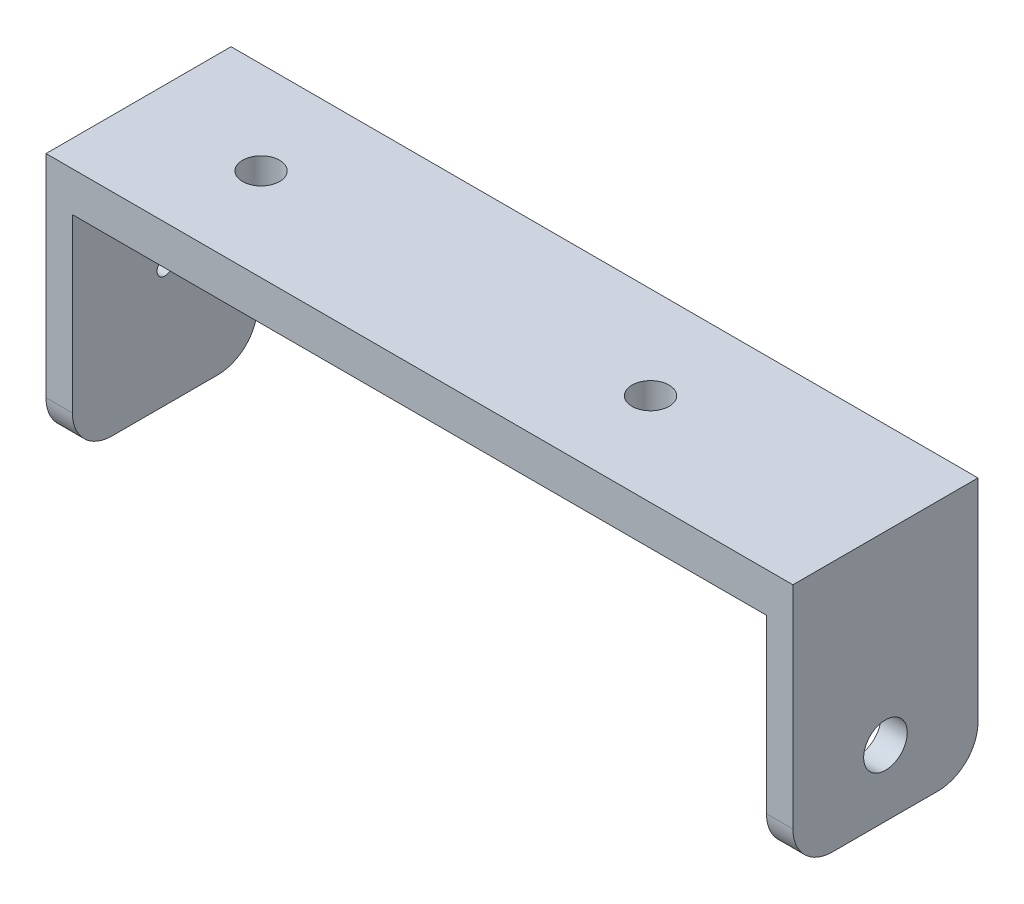
ISO-10303-21;
HEADER;
FILE_DESCRIPTION(('STEP AP214'),'2;1');
FILE_NAME('part.step','',(''),(''),'','','');
FILE_SCHEMA(('AUTOMOTIVE_DESIGN { 1 0 10303 214 1 1 1 1 }'));
ENDSEC;
DATA;
#1=APPLICATION_CONTEXT('core data for automotive mechanical design processes');
#2=APPLICATION_PROTOCOL_DEFINITION('international standard','automotive_design',2000,#1);
#3=PRODUCT_CONTEXT('',#1,'mechanical');
#4=PRODUCT('Part','Part','',(#3));
#5=PRODUCT_RELATED_PRODUCT_CATEGORY('part','',(#4));
#6=PRODUCT_DEFINITION_FORMATION('','',#4);
#7=PRODUCT_DEFINITION_CONTEXT('part definition',#1,'design');
#8=PRODUCT_DEFINITION('design','',#6,#7);
#9=PRODUCT_DEFINITION_SHAPE('','',#8);
#10=(LENGTH_UNIT() NAMED_UNIT(*) SI_UNIT(.MILLI.,.METRE.));
#11=(NAMED_UNIT(*) PLANE_ANGLE_UNIT() SI_UNIT($,.RADIAN.));
#12=(NAMED_UNIT(*) SI_UNIT($,.STERADIAN.) SOLID_ANGLE_UNIT());
#13=UNCERTAINTY_MEASURE_WITH_UNIT(LENGTH_MEASURE(1.E-05),#10,'distance_accuracy_value','');
#14=(GEOMETRIC_REPRESENTATION_CONTEXT(3) GLOBAL_UNCERTAINTY_ASSIGNED_CONTEXT((#13)) GLOBAL_UNIT_ASSIGNED_CONTEXT((#10,
#11,#12)) REPRESENTATION_CONTEXT('',''));
#15=CARTESIAN_POINT('',(0.,0.,0.));
#16=DIRECTION('',(0.,0.,1.));
#17=DIRECTION('',(1.,0.,0.));
#18=AXIS2_PLACEMENT_3D('',#15,#16,#17);
#19=CARTESIAN_POINT('',(0.,16.,14.));
#20=DIRECTION('',(0.,-1.,0.));
#21=DIRECTION('',(1.,0.,0.));
#22=AXIS2_PLACEMENT_3D('',#19,#20,#21);
#23=PLANE('',#22);
#24=CARTESIAN_POINT('',(-18.98,16.,7.));
#25=DIRECTION('',(0.,-1.,0.));
#26=DIRECTION('',(1.,0.,0.));
#27=AXIS2_PLACEMENT_3D('',#24,#25,#26);
#28=CIRCLE('',#27,1.4);
#29=CARTESIAN_POINT('',(-17.58,16.,7.));
#30=VERTEX_POINT('',#29);
#31=EDGE_CURVE('E252',#30,#30,#28,.T.);
#32=ORIENTED_EDGE('',*,*,#31,.F.);
#33=EDGE_LOOP('',(#32));
#34=FACE_BOUND('',#33,.T.);
#35=CARTESIAN_POINT('',(10.48,16.,7.));
#36=DIRECTION('',(0.,-1.,0.));
#37=DIRECTION('',(1.,0.,0.));
#38=AXIS2_PLACEMENT_3D('',#35,#36,#37);
#39=CIRCLE('',#38,1.4);
#40=CARTESIAN_POINT('',(11.88,16.,7.));
#41=VERTEX_POINT('',#40);
#42=EDGE_CURVE('E247',#41,#41,#39,.T.);
#43=ORIENTED_EDGE('',*,*,#42,.F.);
#44=EDGE_LOOP('',(#43));
#45=FACE_BOUND('',#44,.T.);
#46=DIRECTION('',(-1.,0.,0.));
#47=VECTOR('',#46,1.);
#48=CARTESIAN_POINT('',(0.,16.,0.));
#49=LINE('',#48,#47);
#50=CARTESIAN_POINT('',(26.25,16.,0.));
#51=VERTEX_POINT('',#50);
#52=CARTESIAN_POINT('',(-26.25,16.,0.));
#53=VERTEX_POINT('',#52);
#54=EDGE_CURVE('E152',#51,#53,#49,.T.);
#55=ORIENTED_EDGE('',*,*,#54,.F.);
#56=DIRECTION('',(0.,0.,-1.));
#57=VECTOR('',#56,1.);
#58=CARTESIAN_POINT('',(26.25,16.,14.));
#59=LINE('',#58,#57);
#60=CARTESIAN_POINT('',(26.25,16.,14.));
#61=VERTEX_POINT('',#60);
#62=EDGE_CURVE('E139',#61,#51,#59,.T.);
#63=ORIENTED_EDGE('',*,*,#62,.F.);
#64=DIRECTION('',(-1.,0.,0.));
#65=VECTOR('',#64,1.);
#66=CARTESIAN_POINT('',(0.,16.,14.));
#67=LINE('',#66,#65);
#68=CARTESIAN_POINT('',(-26.25,16.,14.));
#69=VERTEX_POINT('',#68);
#70=EDGE_CURVE('E146',#61,#69,#67,.T.);
#71=ORIENTED_EDGE('',*,*,#70,.T.);
#72=DIRECTION('',(0.,0.,-1.));
#73=VECTOR('',#72,1.);
#74=CARTESIAN_POINT('',(-26.25,16.,14.));
#75=LINE('',#74,#73);
#76=EDGE_CURVE('E175',#69,#53,#75,.T.);
#77=ORIENTED_EDGE('',*,*,#76,.T.);
#78=EDGE_LOOP('',(#55,#63,#71,#77));
#79=FACE_BOUND('',#78,.T.);
#80=ADVANCED_FACE('F41',(#34,#45,#79),#23,.T.);
#81=CARTESIAN_POINT('',(26.25,0.,14.));
#82=DIRECTION('',(-1.,0.,0.));
#83=DIRECTION('',(0.,0.,1.));
#84=AXIS2_PLACEMENT_3D('',#81,#82,#83);
#85=PLANE('',#84);
#86=CARTESIAN_POINT('',(26.25,5.00000000000001,7.));
#87=DIRECTION('',(-1.,0.,0.));
#88=DIRECTION('',(0.,0.,1.));
#89=AXIS2_PLACEMENT_3D('',#86,#87,#88);
#90=CIRCLE('',#89,1.65);
#91=CARTESIAN_POINT('',(26.25,5.00000000000001,8.65));
#92=VERTEX_POINT('',#91);
#93=EDGE_CURVE('E164',#92,#92,#90,.F.);
#94=ORIENTED_EDGE('',*,*,#93,.T.);
#95=EDGE_LOOP('',(#94));
#96=FACE_BOUND('',#95,.T.);
#97=DIRECTION('',(0.,0.,-1.));
#98=VECTOR('',#97,1.);
#99=CARTESIAN_POINT('',(26.25,0.,14.));
#100=LINE('',#99,#98);
#101=CARTESIAN_POINT('',(26.25,0.,11.));
#102=VERTEX_POINT('',#101);
#103=CARTESIAN_POINT('',(26.25,0.,3.));
#104=VERTEX_POINT('',#103);
#105=EDGE_CURVE('E154',#102,#104,#100,.T.);
#106=ORIENTED_EDGE('',*,*,#105,.F.);
#107=CARTESIAN_POINT('',(26.25,3.,11.));
#108=DIRECTION('',(-1.,0.,0.));
#109=DIRECTION('',(0.,0.,1.));
#110=AXIS2_PLACEMENT_3D('',#107,#108,#109);
#111=CIRCLE('',#110,3.);
#112=CARTESIAN_POINT('',(26.25,3.,14.));
#113=VERTEX_POINT('',#112);
#114=EDGE_CURVE('E141',#102,#113,#111,.T.);
#115=ORIENTED_EDGE('',*,*,#114,.T.);
#116=DIRECTION('',(0.,1.,0.));
#117=VECTOR('',#116,1.);
#118=CARTESIAN_POINT('',(26.25,0.,14.));
#119=LINE('',#118,#117);
#120=EDGE_CURVE('E134',#113,#61,#119,.T.);
#121=ORIENTED_EDGE('',*,*,#120,.T.);
#122=ORIENTED_EDGE('',*,*,#62,.T.);
#123=DIRECTION('',(0.,1.,0.));
#124=VECTOR('',#123,1.);
#125=CARTESIAN_POINT('',(26.25,0.,0.));
#126=LINE('',#125,#124);
#127=CARTESIAN_POINT('',(26.25,3.,0.));
#128=VERTEX_POINT('',#127);
#129=EDGE_CURVE('E177',#128,#51,#126,.T.);
#130=ORIENTED_EDGE('',*,*,#129,.F.);
#131=CARTESIAN_POINT('',(26.25,3.,3.));
#132=DIRECTION('',(-1.,0.,0.));
#133=DIRECTION('',(0.,0.,1.));
#134=AXIS2_PLACEMENT_3D('',#131,#132,#133);
#135=CIRCLE('',#134,3.);
#136=EDGE_CURVE('E206',#128,#104,#135,.T.);
#137=ORIENTED_EDGE('',*,*,#136,.T.);
#138=EDGE_LOOP('',(#106,#115,#121,#122,#130,#137));
#139=FACE_BOUND('',#138,.T.);
#140=ADVANCED_FACE('F137',(#96,#139),#85,.T.);
#141=CARTESIAN_POINT('',(0.,0.,14.));
#142=DIRECTION('',(0.,-1.,0.));
#143=DIRECTION('',(1.,0.,0.));
#144=AXIS2_PLACEMENT_3D('',#141,#142,#143);
#145=PLANE('',#144);
#146=DIRECTION('',(0.,0.,-1.));
#147=VECTOR('',#146,1.);
#148=CARTESIAN_POINT('',(28.25,0.,14.));
#149=LINE('',#148,#147);
#150=CARTESIAN_POINT('',(28.25,0.,11.));
#151=VERTEX_POINT('',#150);
#152=CARTESIAN_POINT('',(28.25,0.,3.));
#153=VERTEX_POINT('',#152);
#154=EDGE_CURVE('E197',#151,#153,#149,.T.);
#155=ORIENTED_EDGE('',*,*,#154,.F.);
#156=DIRECTION('',(-1.,0.,0.));
#157=VECTOR('',#156,1.);
#158=CARTESIAN_POINT('',(0.,0.,11.));
#159=LINE('',#158,#157);
#160=EDGE_CURVE('E203',#151,#102,#159,.T.);
#161=ORIENTED_EDGE('',*,*,#160,.T.);
#162=ORIENTED_EDGE('',*,*,#105,.T.);
#163=DIRECTION('',(-1.,0.,0.));
#164=VECTOR('',#163,1.);
#165=CARTESIAN_POINT('',(28.25,0.,3.));
#166=LINE('',#165,#164);
#167=EDGE_CURVE('E153',#104,#153,#166,.F.);
#168=ORIENTED_EDGE('',*,*,#167,.T.);
#169=EDGE_LOOP('',(#155,#161,#162,#168));
#170=FACE_BOUND('',#169,.T.);
#171=ADVANCED_FACE('F283',(#170),#145,.T.);
#172=CARTESIAN_POINT('',(28.25,0.,14.));
#173=DIRECTION('',(1.,0.,0.));
#174=DIRECTION('',(0.,1.,0.));
#175=AXIS2_PLACEMENT_3D('',#172,#173,#174);
#176=PLANE('',#175);
#177=CARTESIAN_POINT('',(28.25,5.00000000000001,7.));
#178=DIRECTION('',(1.,0.,0.));
#179=DIRECTION('',(0.,0.,-1.));
#180=AXIS2_PLACEMENT_3D('',#177,#178,#179);
#181=CIRCLE('',#180,1.65);
#182=CARTESIAN_POINT('',(28.25,5.00000000000001,5.35));
#183=VERTEX_POINT('',#182);
#184=EDGE_CURVE('E254',#183,#183,#181,.T.);
#185=ORIENTED_EDGE('',*,*,#184,.F.);
#186=EDGE_LOOP('',(#185));
#187=FACE_BOUND('',#186,.T.);
#188=DIRECTION('',(0.,-1.,0.));
#189=VECTOR('',#188,1.);
#190=CARTESIAN_POINT('',(28.25,0.,14.));
#191=LINE('',#190,#189);
#192=CARTESIAN_POINT('',(28.25,19.,14.));
#193=VERTEX_POINT('',#192);
#194=CARTESIAN_POINT('',(28.25,3.,14.));
#195=VERTEX_POINT('',#194);
#196=EDGE_CURVE('E145',#193,#195,#191,.T.);
#197=ORIENTED_EDGE('',*,*,#196,.T.);
#198=CARTESIAN_POINT('',(28.25,3.,11.));
#199=DIRECTION('',(1.,0.,0.));
#200=DIRECTION('',(0.,1.,0.));
#201=AXIS2_PLACEMENT_3D('',#198,#199,#200);
#202=CIRCLE('',#201,3.);
#203=EDGE_CURVE('E215',#195,#151,#202,.T.);
#204=ORIENTED_EDGE('',*,*,#203,.T.);
#205=ORIENTED_EDGE('',*,*,#154,.T.);
#206=CARTESIAN_POINT('',(28.25,3.,3.));
#207=DIRECTION('',(1.,0.,0.));
#208=DIRECTION('',(0.,1.,0.));
#209=AXIS2_PLACEMENT_3D('',#206,#207,#208);
#210=CIRCLE('',#209,3.);
#211=CARTESIAN_POINT('',(28.25,3.,0.));
#212=VERTEX_POINT('',#211);
#213=EDGE_CURVE('E213',#153,#212,#210,.T.);
#214=ORIENTED_EDGE('',*,*,#213,.T.);
#215=DIRECTION('',(0.,-1.,0.));
#216=VECTOR('',#215,1.);
#217=CARTESIAN_POINT('',(28.25,0.,0.));
#218=LINE('',#217,#216);
#219=CARTESIAN_POINT('',(28.25,19.,0.));
#220=VERTEX_POINT('',#219);
#221=EDGE_CURVE('E179',#220,#212,#218,.T.);
#222=ORIENTED_EDGE('',*,*,#221,.F.);
#223=DIRECTION('',(0.,0.,-1.));
#224=VECTOR('',#223,1.);
#225=CARTESIAN_POINT('',(28.25,19.,14.));
#226=LINE('',#225,#224);
#227=EDGE_CURVE('E195',#193,#220,#226,.T.);
#228=ORIENTED_EDGE('',*,*,#227,.F.);
#229=EDGE_LOOP('',(#197,#204,#205,#214,#222,#228));
#230=FACE_BOUND('',#229,.T.);
#231=ADVANCED_FACE('F323',(#187,#230),#176,.T.);
#232=CARTESIAN_POINT('',(0.,19.,14.));
#233=DIRECTION('',(0.,1.,0.));
#234=DIRECTION('',(0.,0.,1.));
#235=AXIS2_PLACEMENT_3D('',#232,#233,#234);
#236=PLANE('',#235);
#237=CARTESIAN_POINT('',(-18.98,19.,7.));
#238=DIRECTION('',(0.,1.,0.));
#239=DIRECTION('',(0.,0.,1.));
#240=AXIS2_PLACEMENT_3D('',#237,#238,#239);
#241=CIRCLE('',#240,1.4);
#242=CARTESIAN_POINT('',(-18.98,19.,8.4));
#243=VERTEX_POINT('',#242);
#244=EDGE_CURVE('E244',#243,#243,#241,.T.);
#245=ORIENTED_EDGE('',*,*,#244,.F.);
#246=EDGE_LOOP('',(#245));
#247=FACE_BOUND('',#246,.T.);
#248=CARTESIAN_POINT('',(10.48,19.,7.));
#249=DIRECTION('',(0.,1.,0.));
#250=DIRECTION('',(0.,0.,1.));
#251=AXIS2_PLACEMENT_3D('',#248,#249,#250);
#252=CIRCLE('',#251,1.4);
#253=CARTESIAN_POINT('',(10.48,19.,8.4));
#254=VERTEX_POINT('',#253);
#255=EDGE_CURVE('E235',#254,#254,#252,.T.);
#256=ORIENTED_EDGE('',*,*,#255,.F.);
#257=EDGE_LOOP('',(#256));
#258=FACE_BOUND('',#257,.T.);
#259=DIRECTION('',(1.,0.,0.));
#260=VECTOR('',#259,1.);
#261=CARTESIAN_POINT('',(0.,19.,0.));
#262=LINE('',#261,#260);
#263=CARTESIAN_POINT('',(-28.25,19.,0.));
#264=VERTEX_POINT('',#263);
#265=EDGE_CURVE('E182',#264,#220,#262,.T.);
#266=ORIENTED_EDGE('',*,*,#265,.F.);
#267=DIRECTION('',(0.,0.,-1.));
#268=VECTOR('',#267,1.);
#269=CARTESIAN_POINT('',(-28.25,19.,14.));
#270=LINE('',#269,#268);
#271=CARTESIAN_POINT('',(-28.25,19.,14.));
#272=VERTEX_POINT('',#271);
#273=EDGE_CURVE('E192',#272,#264,#270,.T.);
#274=ORIENTED_EDGE('',*,*,#273,.F.);
#275=DIRECTION('',(1.,0.,0.));
#276=VECTOR('',#275,1.);
#277=CARTESIAN_POINT('',(0.,19.,14.));
#278=LINE('',#277,#276);
#279=EDGE_CURVE('E169',#272,#193,#278,.T.);
#280=ORIENTED_EDGE('',*,*,#279,.T.);
#281=ORIENTED_EDGE('',*,*,#227,.T.);
#282=EDGE_LOOP('',(#266,#274,#280,#281));
#283=FACE_BOUND('',#282,.T.);
#284=ADVANCED_FACE('F312',(#247,#258,#283),#236,.T.);
#285=CARTESIAN_POINT('',(-28.25,0.,14.));
#286=DIRECTION('',(-1.,0.,0.));
#287=DIRECTION('',(0.,0.,1.));
#288=AXIS2_PLACEMENT_3D('',#285,#286,#287);
#289=PLANE('',#288);
#290=CARTESIAN_POINT('',(-28.25,9.08500000000001,7.));
#291=DIRECTION('',(-1.,0.,0.));
#292=DIRECTION('',(0.,0.,1.));
#293=AXIS2_PLACEMENT_3D('',#290,#291,#292);
#294=CIRCLE('',#293,0.6);
#295=CARTESIAN_POINT('',(-28.25,9.08500000000001,7.6));
#296=VERTEX_POINT('',#295);
#297=EDGE_CURVE('E231',#296,#296,#294,.T.);
#298=ORIENTED_EDGE('',*,*,#297,.F.);
#299=EDGE_LOOP('',(#298));
#300=FACE_BOUND('',#299,.T.);
#301=CARTESIAN_POINT('',(-28.25,13.085,7.));
#302=DIRECTION('',(-1.,0.,0.));
#303=DIRECTION('',(0.,0.,1.));
#304=AXIS2_PLACEMENT_3D('',#301,#302,#303);
#305=CIRCLE('',#304,0.6);
#306=CARTESIAN_POINT('',(-28.25,13.085,7.6));
#307=VERTEX_POINT('',#306);
#308=EDGE_CURVE('E237',#307,#307,#305,.T.);
#309=ORIENTED_EDGE('',*,*,#308,.F.);
#310=EDGE_LOOP('',(#309));
#311=FACE_BOUND('',#310,.T.);
#312=DIRECTION('',(0.,0.,-1.));
#313=VECTOR('',#312,1.);
#314=CARTESIAN_POINT('',(-28.25,0.,14.));
#315=LINE('',#314,#313);
#316=CARTESIAN_POINT('',(-28.25,0.,11.));
#317=VERTEX_POINT('',#316);
#318=CARTESIAN_POINT('',(-28.25,0.,3.));
#319=VERTEX_POINT('',#318);
#320=EDGE_CURVE('E189',#317,#319,#315,.T.);
#321=ORIENTED_EDGE('',*,*,#320,.F.);
#322=CARTESIAN_POINT('',(-28.25,2.99999999999996,11.));
#323=DIRECTION('',(-1.,0.,0.));
#324=DIRECTION('',(0.,0.,1.));
#325=AXIS2_PLACEMENT_3D('',#322,#323,#324);
#326=CIRCLE('',#325,3.);
#327=CARTESIAN_POINT('',(-28.25,2.99999999999996,14.));
#328=VERTEX_POINT('',#327);
#329=EDGE_CURVE('E223',#317,#328,#326,.T.);
#330=ORIENTED_EDGE('',*,*,#329,.T.);
#331=DIRECTION('',(0.,1.,0.));
#332=VECTOR('',#331,1.);
#333=CARTESIAN_POINT('',(-28.25,0.,14.));
#334=LINE('',#333,#332);
#335=EDGE_CURVE('E172',#328,#272,#334,.T.);
#336=ORIENTED_EDGE('',*,*,#335,.T.);
#337=ORIENTED_EDGE('',*,*,#273,.T.);
#338=DIRECTION('',(0.,1.,0.));
#339=VECTOR('',#338,1.);
#340=CARTESIAN_POINT('',(-28.25,0.,0.));
#341=LINE('',#340,#339);
#342=CARTESIAN_POINT('',(-28.25,2.99999999999996,0.));
#343=VERTEX_POINT('',#342);
#344=EDGE_CURVE('E161',#343,#264,#341,.T.);
#345=ORIENTED_EDGE('',*,*,#344,.F.);
#346=CARTESIAN_POINT('',(-28.25,2.99999999999996,3.));
#347=DIRECTION('',(-1.,0.,0.));
#348=DIRECTION('',(0.,0.,1.));
#349=AXIS2_PLACEMENT_3D('',#346,#347,#348);
#350=CIRCLE('',#349,3.);
#351=EDGE_CURVE('E66',#343,#319,#350,.T.);
#352=ORIENTED_EDGE('',*,*,#351,.T.);
#353=EDGE_LOOP('',(#321,#330,#336,#337,#345,#352));
#354=FACE_BOUND('',#353,.T.);
#355=ADVANCED_FACE('F306',(#300,#311,#354),#289,.T.);
#356=CARTESIAN_POINT('',(0.,0.,14.));
#357=DIRECTION('',(0.,-1.,0.));
#358=DIRECTION('',(1.,0.,0.));
#359=AXIS2_PLACEMENT_3D('',#356,#357,#358);
#360=PLANE('',#359);
#361=DIRECTION('',(0.,0.,-1.));
#362=VECTOR('',#361,1.);
#363=CARTESIAN_POINT('',(-26.25,0.,14.));
#364=LINE('',#363,#362);
#365=CARTESIAN_POINT('',(-26.25,0.,11.));
#366=VERTEX_POINT('',#365);
#367=CARTESIAN_POINT('',(-26.25,0.,3.));
#368=VERTEX_POINT('',#367);
#369=EDGE_CURVE('E187',#366,#368,#364,.T.);
#370=ORIENTED_EDGE('',*,*,#369,.F.);
#371=DIRECTION('',(-1.,0.,0.));
#372=VECTOR('',#371,1.);
#373=CARTESIAN_POINT('',(0.,0.,11.));
#374=LINE('',#373,#372);
#375=EDGE_CURVE('E219',#366,#317,#374,.T.);
#376=ORIENTED_EDGE('',*,*,#375,.T.);
#377=ORIENTED_EDGE('',*,*,#320,.T.);
#378=DIRECTION('',(-1.,0.,0.));
#379=VECTOR('',#378,1.);
#380=CARTESIAN_POINT('',(-26.25,0.,3.));
#381=LINE('',#380,#379);
#382=EDGE_CURVE('E217',#319,#368,#381,.F.);
#383=ORIENTED_EDGE('',*,*,#382,.T.);
#384=EDGE_LOOP('',(#370,#376,#377,#383));
#385=FACE_BOUND('',#384,.T.);
#386=ADVANCED_FACE('F336',(#385),#360,.T.);
#387=CARTESIAN_POINT('',(-26.25,0.,14.));
#388=DIRECTION('',(1.,0.,0.));
#389=DIRECTION('',(0.,1.,0.));
#390=AXIS2_PLACEMENT_3D('',#387,#388,#389);
#391=PLANE('',#390);
#392=CARTESIAN_POINT('',(-26.25,9.08500000000001,7.));
#393=DIRECTION('',(1.,0.,0.));
#394=DIRECTION('',(0.,1.,0.));
#395=AXIS2_PLACEMENT_3D('',#392,#393,#394);
#396=CIRCLE('',#395,0.6);
#397=CARTESIAN_POINT('',(-26.25,9.68500000000001,7.));
#398=VERTEX_POINT('',#397);
#399=EDGE_CURVE('E45',#398,#398,#396,.T.);
#400=ORIENTED_EDGE('',*,*,#399,.F.);
#401=EDGE_LOOP('',(#400));
#402=FACE_BOUND('',#401,.T.);
#403=CARTESIAN_POINT('',(-26.25,13.085,7.));
#404=DIRECTION('',(1.,0.,0.));
#405=DIRECTION('',(0.,1.,0.));
#406=AXIS2_PLACEMENT_3D('',#403,#404,#405);
#407=CIRCLE('',#406,0.6);
#408=CARTESIAN_POINT('',(-26.25,13.685,7.));
#409=VERTEX_POINT('',#408);
#410=EDGE_CURVE('E229',#409,#409,#407,.T.);
#411=ORIENTED_EDGE('',*,*,#410,.F.);
#412=EDGE_LOOP('',(#411));
#413=FACE_BOUND('',#412,.T.);
#414=DIRECTION('',(0.,-1.,0.));
#415=VECTOR('',#414,1.);
#416=CARTESIAN_POINT('',(-26.25,0.,14.));
#417=LINE('',#416,#415);
#418=CARTESIAN_POINT('',(-26.25,2.99999999999996,14.));
#419=VERTEX_POINT('',#418);
#420=EDGE_CURVE('E158',#69,#419,#417,.T.);
#421=ORIENTED_EDGE('',*,*,#420,.T.);
#422=CARTESIAN_POINT('',(-26.25,2.99999999999996,11.));
#423=DIRECTION('',(1.,0.,0.));
#424=DIRECTION('',(0.,1.,0.));
#425=AXIS2_PLACEMENT_3D('',#422,#423,#424);
#426=CIRCLE('',#425,3.);
#427=EDGE_CURVE('E226',#419,#366,#426,.T.);
#428=ORIENTED_EDGE('',*,*,#427,.T.);
#429=ORIENTED_EDGE('',*,*,#369,.T.);
#430=CARTESIAN_POINT('',(-26.25,2.99999999999996,3.));
#431=DIRECTION('',(1.,0.,0.));
#432=DIRECTION('',(0.,1.,0.));
#433=AXIS2_PLACEMENT_3D('',#430,#431,#432);
#434=CIRCLE('',#433,3.);
#435=CARTESIAN_POINT('',(-26.25,2.99999999999996,0.));
#436=VERTEX_POINT('',#435);
#437=EDGE_CURVE('E58',#368,#436,#434,.T.);
#438=ORIENTED_EDGE('',*,*,#437,.T.);
#439=DIRECTION('',(0.,-1.,0.));
#440=VECTOR('',#439,1.);
#441=CARTESIAN_POINT('',(-26.25,0.,0.));
#442=LINE('',#441,#440);
#443=EDGE_CURVE('E159',#53,#436,#442,.T.);
#444=ORIENTED_EDGE('',*,*,#443,.F.);
#445=ORIENTED_EDGE('',*,*,#76,.F.);
#446=EDGE_LOOP('',(#421,#428,#429,#438,#444,#445));
#447=FACE_BOUND('',#446,.T.);
#448=ADVANCED_FACE('F340',(#402,#413,#447),#391,.T.);
#449=CARTESIAN_POINT('',(0.,0.,14.));
#450=DIRECTION('',(0.,0.,1.));
#451=DIRECTION('',(1.,0.,0.));
#452=AXIS2_PLACEMENT_3D('',#449,#450,#451);
#453=PLANE('',#452);
#454=ORIENTED_EDGE('',*,*,#120,.F.);
#455=DIRECTION('',(-1.,0.,0.));
#456=VECTOR('',#455,1.);
#457=CARTESIAN_POINT('',(0.,3.,14.));
#458=LINE('',#457,#456);
#459=EDGE_CURVE('E211',#113,#195,#458,.F.);
#460=ORIENTED_EDGE('',*,*,#459,.T.);
#461=ORIENTED_EDGE('',*,*,#196,.F.);
#462=ORIENTED_EDGE('',*,*,#279,.F.);
#463=ORIENTED_EDGE('',*,*,#335,.F.);
#464=DIRECTION('',(-1.,0.,0.));
#465=VECTOR('',#464,1.);
#466=CARTESIAN_POINT('',(0.,3.,14.));
#467=LINE('',#466,#465);
#468=EDGE_CURVE('E209',#328,#419,#467,.F.);
#469=ORIENTED_EDGE('',*,*,#468,.T.);
#470=ORIENTED_EDGE('',*,*,#420,.F.);
#471=ORIENTED_EDGE('',*,*,#70,.F.);
#472=EDGE_LOOP('',(#454,#460,#461,#462,#463,#469,#470,#471));
#473=FACE_BOUND('',#472,.T.);
#474=ADVANCED_FACE('F156',(#473),#453,.T.);
#475=CARTESIAN_POINT('',(0.,0.,0.));
#476=DIRECTION('',(0.,0.,1.));
#477=DIRECTION('',(1.,0.,0.));
#478=AXIS2_PLACEMENT_3D('',#475,#476,#477);
#479=PLANE('',#478);
#480=ORIENTED_EDGE('',*,*,#443,.T.);
#481=DIRECTION('',(-1.,0.,0.));
#482=VECTOR('',#481,1.);
#483=CARTESIAN_POINT('',(-28.25,2.99999999999996,0.));
#484=LINE('',#483,#482);
#485=EDGE_CURVE('E11',#436,#343,#484,.T.);
#486=ORIENTED_EDGE('',*,*,#485,.T.);
#487=ORIENTED_EDGE('',*,*,#344,.T.);
#488=ORIENTED_EDGE('',*,*,#265,.T.);
#489=ORIENTED_EDGE('',*,*,#221,.T.);
#490=DIRECTION('',(-1.,0.,0.));
#491=VECTOR('',#490,1.);
#492=CARTESIAN_POINT('',(26.25,3.,0.));
#493=LINE('',#492,#491);
#494=EDGE_CURVE('E50',#212,#128,#493,.T.);
#495=ORIENTED_EDGE('',*,*,#494,.T.);
#496=ORIENTED_EDGE('',*,*,#129,.T.);
#497=ORIENTED_EDGE('',*,*,#54,.T.);
#498=EDGE_LOOP('',(#480,#486,#487,#488,#489,#495,#496,#497));
#499=FACE_BOUND('',#498,.T.);
#500=ADVANCED_FACE('F265',(#499),#479,.F.);
#501=CARTESIAN_POINT('',(21.5830952441688,5.00000000000001,7.));
#502=DIRECTION('',(1.,0.,0.));
#503=DIRECTION('',(0.,0.,-1.));
#504=AXIS2_PLACEMENT_3D('',#501,#502,#503);
#505=CYLINDRICAL_SURFACE('',#504,1.65);
#506=ORIENTED_EDGE('',*,*,#184,.T.);
#507=EDGE_LOOP('',(#506));
#508=FACE_BOUND('',#507,.T.);
#509=ORIENTED_EDGE('',*,*,#93,.F.);
#510=EDGE_LOOP('',(#509));
#511=FACE_BOUND('',#510,.T.);
#512=ADVANCED_FACE('F262',(#508,#511),#505,.F.);
#513=CARTESIAN_POINT('',(10.48,5.,7.));
#514=DIRECTION('',(0.,1.,0.));
#515=DIRECTION('',(0.,0.,1.));
#516=AXIS2_PLACEMENT_3D('',#513,#514,#515);
#517=CYLINDRICAL_SURFACE('',#516,1.4);
#518=ORIENTED_EDGE('',*,*,#42,.T.);
#519=EDGE_LOOP('',(#518));
#520=FACE_BOUND('',#519,.T.);
#521=ORIENTED_EDGE('',*,*,#255,.T.);
#522=EDGE_LOOP('',(#521));
#523=FACE_BOUND('',#522,.T.);
#524=ADVANCED_FACE('F264',(#520,#523),#517,.F.);
#525=CARTESIAN_POINT('',(-18.98,5.,7.));
#526=DIRECTION('',(0.,1.,0.));
#527=DIRECTION('',(0.,0.,1.));
#528=AXIS2_PLACEMENT_3D('',#525,#526,#527);
#529=CYLINDRICAL_SURFACE('',#528,1.4);
#530=ORIENTED_EDGE('',*,*,#31,.T.);
#531=EDGE_LOOP('',(#530));
#532=FACE_BOUND('',#531,.T.);
#533=ORIENTED_EDGE('',*,*,#244,.T.);
#534=EDGE_LOOP('',(#533));
#535=FACE_BOUND('',#534,.T.);
#536=ADVANCED_FACE('F271',(#532,#535),#529,.F.);
#537=CARTESIAN_POINT('',(0.,3.,11.));
#538=DIRECTION('',(-1.,0.,0.));
#539=DIRECTION('',(0.,-1.,0.));
#540=AXIS2_PLACEMENT_3D('',#537,#538,#539);
#541=CYLINDRICAL_SURFACE('',#540,3.);
#542=ORIENTED_EDGE('',*,*,#203,.F.);
#543=ORIENTED_EDGE('',*,*,#459,.F.);
#544=ORIENTED_EDGE('',*,*,#114,.F.);
#545=ORIENTED_EDGE('',*,*,#160,.F.);
#546=EDGE_LOOP('',(#542,#543,#544,#545));
#547=FACE_BOUND('',#546,.T.);
#548=ADVANCED_FACE('F289',(#547),#541,.T.);
#549=CARTESIAN_POINT('',(0.,3.,11.));
#550=DIRECTION('',(-1.,0.,0.));
#551=DIRECTION('',(0.,-1.,0.));
#552=AXIS2_PLACEMENT_3D('',#549,#550,#551);
#553=CYLINDRICAL_SURFACE('',#552,3.);
#554=ORIENTED_EDGE('',*,*,#427,.F.);
#555=ORIENTED_EDGE('',*,*,#468,.F.);
#556=ORIENTED_EDGE('',*,*,#329,.F.);
#557=ORIENTED_EDGE('',*,*,#375,.F.);
#558=EDGE_LOOP('',(#554,#555,#556,#557));
#559=FACE_BOUND('',#558,.T.);
#560=ADVANCED_FACE('F292',(#559),#553,.T.);
#561=CARTESIAN_POINT('',(0.,3.,3.));
#562=DIRECTION('',(1.,0.,0.));
#563=DIRECTION('',(0.,1.,0.));
#564=AXIS2_PLACEMENT_3D('',#561,#562,#563);
#565=CYLINDRICAL_SURFACE('',#564,3.);
#566=ORIENTED_EDGE('',*,*,#437,.F.);
#567=ORIENTED_EDGE('',*,*,#382,.F.);
#568=ORIENTED_EDGE('',*,*,#351,.F.);
#569=ORIENTED_EDGE('',*,*,#485,.F.);
#570=EDGE_LOOP('',(#566,#567,#568,#569));
#571=FACE_BOUND('',#570,.T.);
#572=ADVANCED_FACE('F295',(#571),#565,.T.);
#573=CARTESIAN_POINT('',(0.,3.,3.));
#574=DIRECTION('',(1.,0.,0.));
#575=DIRECTION('',(0.,1.,0.));
#576=AXIS2_PLACEMENT_3D('',#573,#574,#575);
#577=CYLINDRICAL_SURFACE('',#576,3.);
#578=ORIENTED_EDGE('',*,*,#213,.F.);
#579=ORIENTED_EDGE('',*,*,#167,.F.);
#580=ORIENTED_EDGE('',*,*,#136,.F.);
#581=ORIENTED_EDGE('',*,*,#494,.F.);
#582=EDGE_LOOP('',(#578,#579,#580,#581));
#583=FACE_BOUND('',#582,.T.);
#584=ADVANCED_FACE('F43',(#583),#577,.T.);
#585=CARTESIAN_POINT('',(-18.25,13.085,7.));
#586=DIRECTION('',(-1.,0.,0.));
#587=DIRECTION('',(0.,0.,1.));
#588=AXIS2_PLACEMENT_3D('',#585,#586,#587);
#589=CYLINDRICAL_SURFACE('',#588,0.6);
#590=ORIENTED_EDGE('',*,*,#410,.T.);
#591=EDGE_LOOP('',(#590));
#592=FACE_BOUND('',#591,.T.);
#593=ORIENTED_EDGE('',*,*,#308,.T.);
#594=EDGE_LOOP('',(#593));
#595=FACE_BOUND('',#594,.T.);
#596=ADVANCED_FACE('F301',(#592,#595),#589,.F.);
#597=CARTESIAN_POINT('',(-18.25,9.08500000000001,7.));
#598=DIRECTION('',(-1.,0.,0.));
#599=DIRECTION('',(0.,0.,1.));
#600=AXIS2_PLACEMENT_3D('',#597,#598,#599);
#601=CYLINDRICAL_SURFACE('',#600,0.6);
#602=ORIENTED_EDGE('',*,*,#399,.T.);
#603=EDGE_LOOP('',(#602));
#604=FACE_BOUND('',#603,.T.);
#605=ORIENTED_EDGE('',*,*,#297,.T.);
#606=EDGE_LOOP('',(#605));
#607=FACE_BOUND('',#606,.T.);
#608=ADVANCED_FACE('F402',(#604,#607),#601,.F.);
#609=CLOSED_SHELL('',(#80,#140,#171,#231,#284,#355,#386,#448,#474,#500,#512,#524,#536,#548,#560,
#572,#584,#596,#608));
#610=MANIFOLD_SOLID_BREP('B2',#609);
#611=ADVANCED_BREP_SHAPE_REPRESENTATION('',(#18,#610),#14);
#612=SHAPE_DEFINITION_REPRESENTATION(#9,#611);
ENDSEC;
END-ISO-10303-21;
